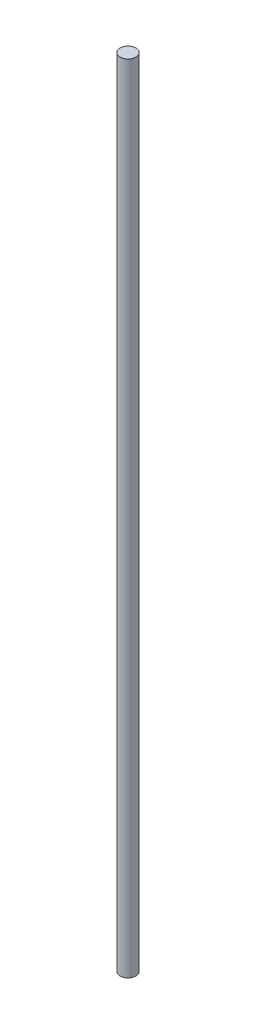
ISO-10303-21;
HEADER;
FILE_DESCRIPTION(('STEP AP214'),'2;1');
FILE_NAME('part.step','',(''),(''),'','','');
FILE_SCHEMA(('AUTOMOTIVE_DESIGN { 1 0 10303 214 1 1 1 1 }'));
ENDSEC;
DATA;
#1=APPLICATION_CONTEXT('core data for automotive mechanical design processes');
#2=APPLICATION_PROTOCOL_DEFINITION('international standard','automotive_design',2000,#1);
#3=PRODUCT_CONTEXT('',#1,'mechanical');
#4=PRODUCT('Part','Part','',(#3));
#5=PRODUCT_RELATED_PRODUCT_CATEGORY('part','',(#4));
#6=PRODUCT_DEFINITION_FORMATION('','',#4);
#7=PRODUCT_DEFINITION_CONTEXT('part definition',#1,'design');
#8=PRODUCT_DEFINITION('design','',#6,#7);
#9=PRODUCT_DEFINITION_SHAPE('','',#8);
#10=(LENGTH_UNIT() NAMED_UNIT(*) SI_UNIT(.MILLI.,.METRE.));
#11=(NAMED_UNIT(*) PLANE_ANGLE_UNIT() SI_UNIT($,.RADIAN.));
#12=(NAMED_UNIT(*) SI_UNIT($,.STERADIAN.) SOLID_ANGLE_UNIT());
#13=UNCERTAINTY_MEASURE_WITH_UNIT(LENGTH_MEASURE(1.E-05),#10,'distance_accuracy_value','');
#14=(GEOMETRIC_REPRESENTATION_CONTEXT(3) GLOBAL_UNCERTAINTY_ASSIGNED_CONTEXT((#13)) GLOBAL_UNIT_ASSIGNED_CONTEXT((#10,
#11,#12)) REPRESENTATION_CONTEXT('',''));
#15=CARTESIAN_POINT('',(0.,0.,0.));
#16=DIRECTION('',(0.,0.,1.));
#17=DIRECTION('',(1.,0.,0.));
#18=AXIS2_PLACEMENT_3D('',#15,#16,#17);
#19=CARTESIAN_POINT('',(0.,200.,0.));
#20=DIRECTION('',(0.,-1.,0.));
#21=DIRECTION('',(0.,0.,-1.));
#22=AXIS2_PLACEMENT_3D('',#19,#20,#21);
#23=CYLINDRICAL_SURFACE('',#22,4.);
#24=CARTESIAN_POINT('',(0.,200.,0.));
#25=DIRECTION('',(0.,1.,0.));
#26=DIRECTION('',(0.,0.,1.));
#27=AXIS2_PLACEMENT_3D('',#24,#25,#26);
#28=CIRCLE('',#27,4.);
#29=CARTESIAN_POINT('',(0.,200.,4.));
#30=VERTEX_POINT('',#29);
#31=EDGE_CURVE('E10',#30,#30,#28,.T.);
#32=ORIENTED_EDGE('',*,*,#31,.F.);
#33=EDGE_LOOP('',(#32));
#34=FACE_BOUND('',#33,.T.);
#35=CARTESIAN_POINT('',(0.,-200.,0.));
#36=DIRECTION('',(0.,1.,0.));
#37=DIRECTION('',(0.,0.,1.));
#38=AXIS2_PLACEMENT_3D('',#35,#36,#37);
#39=CIRCLE('',#38,4.);
#40=CARTESIAN_POINT('',(0.,-200.,4.));
#41=VERTEX_POINT('',#40);
#42=EDGE_CURVE('E35',#41,#41,#39,.T.);
#43=ORIENTED_EDGE('',*,*,#42,.T.);
#44=EDGE_LOOP('',(#43));
#45=FACE_BOUND('',#44,.T.);
#46=ADVANCED_FACE('F32',(#34,#45),#23,.T.);
#47=CARTESIAN_POINT('',(0.,200.,0.));
#48=DIRECTION('',(0.,1.,0.));
#49=DIRECTION('',(0.,0.,1.));
#50=AXIS2_PLACEMENT_3D('',#47,#48,#49);
#51=PLANE('',#50);
#52=ORIENTED_EDGE('',*,*,#31,.T.);
#53=EDGE_LOOP('',(#52));
#54=FACE_BOUND('',#53,.T.);
#55=ADVANCED_FACE('F47',(#54),#51,.T.);
#56=CARTESIAN_POINT('',(0.,-200.,0.));
#57=DIRECTION('',(0.,1.,0.));
#58=DIRECTION('',(0.,0.,1.));
#59=AXIS2_PLACEMENT_3D('',#56,#57,#58);
#60=PLANE('',#59);
#61=ORIENTED_EDGE('',*,*,#42,.F.);
#62=EDGE_LOOP('',(#61));
#63=FACE_BOUND('',#62,.T.);
#64=ADVANCED_FACE('F45',(#63),#60,.F.);
#65=CLOSED_SHELL('',(#46,#55,#64));
#66=MANIFOLD_SOLID_BREP('B2',#65);
#67=ADVANCED_BREP_SHAPE_REPRESENTATION('',(#18,#66),#14);
#68=SHAPE_DEFINITION_REPRESENTATION(#9,#67);
ENDSEC;
END-ISO-10303-21;
